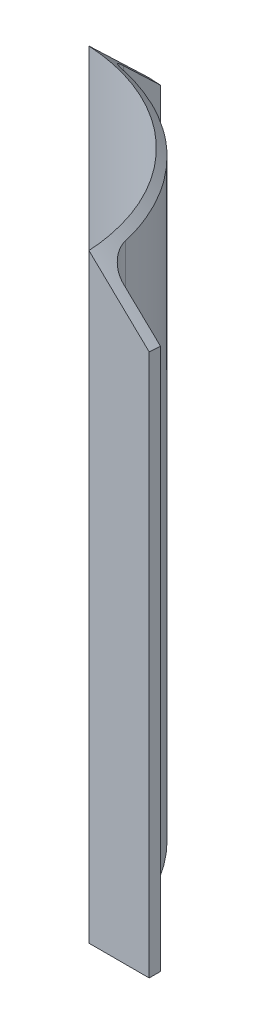
ISO-10303-21;
HEADER;
FILE_DESCRIPTION(('STEP AP214'),'2;1');
FILE_NAME('part.step','',(''),(''),'','','');
FILE_SCHEMA(('AUTOMOTIVE_DESIGN { 1 0 10303 214 1 1 1 1 }'));
ENDSEC;
DATA;
#1=APPLICATION_CONTEXT('core data for automotive mechanical design processes');
#2=APPLICATION_PROTOCOL_DEFINITION('international standard','automotive_design',2000,#1);
#3=PRODUCT_CONTEXT('',#1,'mechanical');
#4=PRODUCT('Part','Part','',(#3));
#5=PRODUCT_RELATED_PRODUCT_CATEGORY('part','',(#4));
#6=PRODUCT_DEFINITION_FORMATION('','',#4);
#7=PRODUCT_DEFINITION_CONTEXT('part definition',#1,'design');
#8=PRODUCT_DEFINITION('design','',#6,#7);
#9=PRODUCT_DEFINITION_SHAPE('','',#8);
#10=(LENGTH_UNIT() NAMED_UNIT(*) SI_UNIT(.MILLI.,.METRE.));
#11=(NAMED_UNIT(*) PLANE_ANGLE_UNIT() SI_UNIT($,.RADIAN.));
#12=(NAMED_UNIT(*) SI_UNIT($,.STERADIAN.) SOLID_ANGLE_UNIT());
#13=UNCERTAINTY_MEASURE_WITH_UNIT(LENGTH_MEASURE(1.E-05),#10,'distance_accuracy_value','');
#14=(GEOMETRIC_REPRESENTATION_CONTEXT(3) GLOBAL_UNCERTAINTY_ASSIGNED_CONTEXT((#13)) GLOBAL_UNIT_ASSIGNED_CONTEXT((#10,
#11,#12)) REPRESENTATION_CONTEXT('',''));
#15=CARTESIAN_POINT('',(0.,0.,0.));
#16=DIRECTION('',(0.,0.,1.));
#17=DIRECTION('',(1.,0.,0.));
#18=AXIS2_PLACEMENT_3D('',#15,#16,#17);
#19=CARTESIAN_POINT('',(0.,254.,0.));
#20=DIRECTION('',(0.,-1.,0.));
#21=DIRECTION('',(0.,0.,-1.));
#22=AXIS2_PLACEMENT_3D('',#19,#20,#21);
#23=CYLINDRICAL_SURFACE('',#22,82.55);
#24=CARTESIAN_POINT('',(80.3934085482758,249.863075794001,-18.7457291666667));
#25=CARTESIAN_POINT('',(80.3055245949603,249.86299530507,-19.1226304650302));
#26=CARTESIAN_POINT('',(80.214991316221,249.862903727339,-19.4989086364188));
#27=CARTESIAN_POINT('',(80.0286418855666,249.862746584679,-20.2501544756968));
#28=CARTESIAN_POINT('',(79.9328257345911,249.862681019746,-20.6251221438193));
#29=CARTESIAN_POINT('',(79.637481566626,249.862595631102,-21.7479443056426));
#30=CARTESIAN_POINT('',(79.4300533918061,249.862687104608,-22.4937370098891));
#31=CARTESIAN_POINT('',(78.994316159201,249.862938018383,-23.9791489815843));
#32=CARTESIAN_POINT('',(78.7660080560754,249.863097455547,-24.7187685295928));
#33=CARTESIAN_POINT('',(78.2886810993482,249.863352071069,-26.1912954488906));
#34=CARTESIAN_POINT('',(78.0396622484314,249.863447249437,-26.92420282105));
#35=CARTESIAN_POINT('',(77.521112248314,249.863547401683,-28.3827175233221));
#36=CARTESIAN_POINT('',(77.2515814249101,249.863552376993,-29.1083249691741));
#37=CARTESIAN_POINT('',(76.6922302653745,249.863533021055,-30.5516519187377));
#38=CARTESIAN_POINT('',(76.4024099283457,249.863508689806,-31.2693714221006));
#39=CARTESIAN_POINT('',(75.5034148686477,249.863413755424,-33.4084950572818));
#40=CARTESIAN_POINT('',(74.8641600647178,249.863321206738,-34.8173998291551));
#41=CARTESIAN_POINT('',(73.507561228147,249.863247879814,-37.5969794099592));
#42=CARTESIAN_POINT('',(72.7902181130919,249.863267100263,-38.9676546678725));
#43=CARTESIAN_POINT('',(71.2796830230458,249.86337279887,-41.6665414689077));
#44=CARTESIAN_POINT('',(70.4864916376567,249.863459276505,-42.994753342009));
#45=CARTESIAN_POINT('',(68.8263900470341,249.863568139322,-45.6050829830951));
#46=CARTESIAN_POINT('',(67.9594520944866,249.86359050027,-46.8871831409907));
#47=CARTESIAN_POINT('',(66.6061393361303,249.863219612162,-48.7721567820583));
#48=CARTESIAN_POINT('',(66.1461896433544,249.863028555391,-49.3941530233712));
#49=CARTESIAN_POINT('',(65.2089987282208,249.862670456499,-50.62496758798));
#50=CARTESIAN_POINT('',(64.731757506005,249.862503414378,-51.233785911384));
#51=CARTESIAN_POINT('',(63.2746135551357,249.862135205062,-53.0397794396304));
#52=CARTESIAN_POINT('',(62.2692090116158,249.862066900778,-54.2166067572427));
#53=CARTESIAN_POINT('',(60.7127733935497,249.86229477692,-55.9380077873409));
#54=CARTESIAN_POINT('',(60.1858149551967,249.862425840402,-56.5045921577349));
#55=CARTESIAN_POINT('',(59.1161567410984,249.862737922734,-57.6227470269512));
#56=CARTESIAN_POINT('',(58.573456964909,249.862918941585,-58.1743175253501));
#57=CARTESIAN_POINT('',(57.4727762095926,249.863258544191,-59.2619705887094));
#58=CARTESIAN_POINT('',(56.914795396594,249.86341712819,-59.7980533219154));
#59=CARTESIAN_POINT('',(55.783982790812,249.863558979771,-60.8543208572356));
#60=CARTESIAN_POINT('',(55.2111509984783,249.863542247358,-61.3745056598308));
#61=CARTESIAN_POINT('',(54.0511064931233,249.863353399875,-62.3985491131762));
#62=CARTESIAN_POINT('',(53.4638943101023,249.863181290523,-62.9024083640318));
#63=CARTESIAN_POINT('',(52.2755547362014,249.862825344858,-63.8934074793317));
#64=CARTESIAN_POINT('',(51.6744273447111,249.862641508545,-64.3805473430428));
#65=CARTESIAN_POINT('',(49.8501759336587,249.862193971594,-65.8168576006078));
#66=CARTESIAN_POINT('',(48.606740953747,249.862034519743,-66.7404258574518));
#67=CARTESIAN_POINT('',(46.0698416891314,249.862207495431,-68.5161994851546));
#68=CARTESIAN_POINT('',(44.7763753699932,249.862539942992,-69.3684019495829));
#69=CARTESIAN_POINT('',(42.8018261315508,249.863077775941,-70.5911177077228));
#70=CARTESIAN_POINT('',(42.1378393133121,249.863263604283,-70.9894678248497));
#71=CARTESIAN_POINT('',(40.7989030548139,249.863505883652,-71.7673420490157));
#72=CARTESIAN_POINT('',(40.1239536063261,249.863562334583,-72.1468661419235));
#73=CARTESIAN_POINT('',(38.7645334552431,249.863479544953,-72.8862907915338));
#74=CARTESIAN_POINT('',(38.0800762806611,249.863340558865,-73.2462162334988));
#75=CARTESIAN_POINT('',(36.7013225338603,249.863018972841,-73.9466925336815));
#76=CARTESIAN_POINT('',(36.0070259946014,249.862836373051,-74.287243456781));
#77=CARTESIAN_POINT('',(34.6092316329639,249.862513419291,-74.9486575814909));
#78=CARTESIAN_POINT('',(33.9057351605362,249.862373059195,-75.2695236330929));
#79=CARTESIAN_POINT('',(32.4900292176766,249.862170298839,-75.891359113194));
#80=CARTESIAN_POINT('',(31.7778196410206,249.862107899532,-76.1923282988378));
#81=CARTESIAN_POINT('',(29.6296589734328,249.862221769584,-77.0647336642277));
#82=CARTESIAN_POINT('',(28.1812872749114,249.862698645436,-77.6060881158168));
#83=CARTESIAN_POINT('',(26.0641581133361,249.86319902854,-78.3303368996885));
#84=CARTESIAN_POINT('',(25.4064311944375,249.863327484554,-78.546132892775));
#85=CARTESIAN_POINT('',(24.0858666064173,249.863491947967,-78.9610810958602));
#86=CARTESIAN_POINT('',(23.4230300137923,249.863527974332,-79.1602367123093));
#87=CARTESIAN_POINT('',(22.0936873677499,249.863552404625,-79.5414911928851));
#88=CARTESIAN_POINT('',(21.4271893940527,249.863540888813,-79.7236182730833));
#89=CARTESIAN_POINT('',(20.0896961360044,249.863473021325,-80.0711194873559));
#90=CARTESIAN_POINT('',(19.4186999677142,249.863416660564,-80.2364902192447));
#91=CARTESIAN_POINT('',(18.7457291666667,249.863339183168,-80.3934085482758));
#92=B_SPLINE_CURVE_WITH_KNOTS('',3,(#24,#25,#26,#27,#28,#29,#30,#31,#32,#33,#34,#35,#36,#37,#38,
#39,#40,#41,#42,#43,#44,#45,#46,#47,#48,#49,#50,#51,#52,#53,#54,#55,#56,#57,#58,#59,#60,#61,#62,
#63,#64,#65,#66,#67,#68,#69,#70,#71,#72,#73,#74,#75,#76,#77,#78,#79,#80,#81,#82,#83,#84,#85,#86,
#87,#88,#89,#90,#91),.UNSPECIFIED.,.F.,.F.,(4,2,2,2,2,2,2,2,2,2,2,2,2,2,2,2,2,2,2,2,2,2,2,2,2,2,
2,2,2,2,2,2,2,4),(0.,1.16101557393366,2.32203094135621,4.64400300459523,6.96586895705798,
9.28773460853185,11.6095633889233,13.9313922719684,18.5701678382414,23.2088889019222,
27.8475739097152,32.4880120190834,34.8084963534964,37.1289806688801,41.7695304906907,
44.0905784441235,46.4116264630263,48.7326492585908,51.0536719839024,53.3746092945134,
55.6955467069252,60.3396523238133,64.9839469838204,67.3066316233998,69.6293180064105,
71.9489828953981,74.2686400157781,76.5879604978694,78.9073092836852,83.5430614214433,
85.6195788327005,87.6956701134023,89.768257999085,91.841265860399),.UNSPECIFIED.);
#93=CARTESIAN_POINT('',(80.3934085482758,249.863075794001,-18.7457291666667));
#94=VERTEX_POINT('',#93);
#95=CARTESIAN_POINT('',(18.7457291666667,249.863339183168,-80.3934085482758));
#96=VERTEX_POINT('',#95);
#97=EDGE_CURVE('E363',#94,#96,#92,.T.);
#98=ORIENTED_EDGE('',*,*,#97,.F.);
#99=CARTESIAN_POINT('',(80.3934085482758,-12.6999999999999,-18.7457291666667));
#100=CARTESIAN_POINT('',(80.3934085482758,80.4333333333334,-18.7457291666667));
#101=CARTESIAN_POINT('',(80.3934085482758,173.566666666667,-18.7457291666667));
#102=CARTESIAN_POINT('',(80.3934085482758,266.7,-18.7457291666667));
#103=(BOUNDED_CURVE() B_SPLINE_CURVE(3,(#99,#100,#101,#102),.UNSPECIFIED.,.F.,
.F.) B_SPLINE_CURVE_WITH_KNOTS((4,4),(-0.0127,0.2667),
.UNSPECIFIED.) CURVE() GEOMETRIC_REPRESENTATION_ITEM() RATIONAL_B_SPLINE_CURVE((1.,1.,1.,1.)) REPRESENTATION_ITEM(''));
#104=CARTESIAN_POINT('',(80.3934085482758,0.,-18.7457291666667));
#105=VERTEX_POINT('',#104);
#106=EDGE_CURVE('E161',#94,#105,#103,.F.);
#107=ORIENTED_EDGE('',*,*,#106,.T.);
#108=CARTESIAN_POINT('',(0.,0.,0.));
#109=DIRECTION('',(0.,1.,0.));
#110=DIRECTION('',(0.,0.,1.));
#111=AXIS2_PLACEMENT_3D('',#108,#109,#110);
#112=CIRCLE('',#111,82.55);
#113=CARTESIAN_POINT('',(18.7457291666667,0.,-80.3934085482758));
#114=VERTEX_POINT('',#113);
#115=EDGE_CURVE('E185',#105,#114,#112,.T.);
#116=ORIENTED_EDGE('',*,*,#115,.T.);
#117=CARTESIAN_POINT('',(18.7457291666667,266.7,-80.3934085482758));
#118=CARTESIAN_POINT('',(18.7457291666667,173.566666666667,-80.3934085482758));
#119=CARTESIAN_POINT('',(18.7457291666667,80.4333333333334,-80.3934085482758));
#120=CARTESIAN_POINT('',(18.7457291666667,-12.6999999999999,-80.3934085482758));
#121=(BOUNDED_CURVE() B_SPLINE_CURVE(3,(#117,#118,#119,#120),.UNSPECIFIED.,.F.,
.F.) B_SPLINE_CURVE_WITH_KNOTS((4,4),(-0.0127,0.2667),
.UNSPECIFIED.) CURVE() GEOMETRIC_REPRESENTATION_ITEM() RATIONAL_B_SPLINE_CURVE((1.,1.,1.,1.)) REPRESENTATION_ITEM(''));
#122=EDGE_CURVE('E386',#114,#96,#121,.F.);
#123=ORIENTED_EDGE('',*,*,#122,.T.);
#124=EDGE_LOOP('',(#98,#107,#116,#123));
#125=FACE_BOUND('',#124,.T.);
#126=ADVANCED_FACE('F50',(#125),#23,.T.);
#127=CARTESIAN_POINT('',(0.,254.,0.));
#128=DIRECTION('',(0.,-1.,0.));
#129=DIRECTION('',(0.,0.,-1.));
#130=AXIS2_PLACEMENT_3D('',#127,#128,#129);
#131=CYLINDRICAL_SURFACE('',#130,79.375);
#132=CARTESIAN_POINT('',(3.57199999653287,252.9078,-79.2948402313923));
#133=CARTESIAN_POINT('',(3.90549281367887,252.9078,-79.2795649705891));
#134=CARTESIAN_POINT('',(4.24779404439881,252.9078,-79.2619222675122));
#135=CARTESIAN_POINT('',(5.27771800259052,252.9078,-79.2025001636546));
#136=CARTESIAN_POINT('',(5.97892391546024,252.9078,-79.1525855339356));
#137=CARTESIAN_POINT('',(7.39205282786649,252.9078,-79.0329024752258));
#138=CARTESIAN_POINT('',(8.10055468042552,252.90779999998,-78.9633313138953));
#139=CARTESIAN_POINT('',(10.2306940018551,252.90780000004,-78.7250170143436));
#140=CARTESIAN_POINT('',(11.6569652350676,252.90779999996,-78.5266730607213));
#141=CARTESIAN_POINT('',(15.9448865923597,252.90780000008,-77.8099425822413));
#142=CARTESIAN_POINT('',(18.8042149825534,252.907800000495,-77.1731014795492));
#143=CARTESIAN_POINT('',(24.5425969659521,252.907799999505,-75.5443382380577));
#144=CARTESIAN_POINT('',(27.3751677170329,252.9078,-74.5649446629202));
#145=CARTESIAN_POINT('',(32.9776852401022,252.9078,-72.2620660439728));
#146=CARTESIAN_POINT('',(35.7362026728139,252.9078,-70.9418250333983));
#147=CARTESIAN_POINT('',(43.7965907292001,252.9078,-66.4827919743856));
#148=CARTESIAN_POINT('',(48.8794150378731,252.9078,-62.8461687845427));
#149=CARTESIAN_POINT('',(58.0457333394796,252.9078,-54.4934031615025));
#150=CARTESIAN_POINT('',(62.126393996879,252.9078,-49.7801106609539));
#151=CARTESIAN_POINT('',(69.0152064792567,252.9078,-39.6818540198957));
#152=CARTESIAN_POINT('',(71.8150868601122,252.907799999183,-34.3207627298455));
#153=CARTESIAN_POINT('',(75.0332702923636,252.907800000409,-26.0601549211691));
#154=CARTESIAN_POINT('',(75.9310978906161,252.9078,-23.300955717258));
#155=CARTESIAN_POINT('',(77.4145679553548,252.9078,-17.76080557649));
#156=CARTESIAN_POINT('',(77.9933096889269,252.9078,-15.0090564604925));
#157=CARTESIAN_POINT('',(78.6410259423052,252.9078,-10.8599746315338));
#158=CARTESIAN_POINT('',(78.8159189303078,252.9078,-9.50174097017848));
#159=CARTESIAN_POINT('',(79.0261256566649,252.9078,-7.46259649540011));
#160=CARTESIAN_POINT('',(79.0871316696156,252.9078,-6.78497901199016));
#161=CARTESIAN_POINT('',(79.1914599093847,252.9078,-5.43463034347688));
#162=CARTESIAN_POINT('',(79.2347820342079,252.9078,-4.7618983190944));
#163=CARTESIAN_POINT('',(79.3041849104643,252.9078,-3.42201554037667));
#164=CARTESIAN_POINT('',(79.3306749729481,252.907799999963,-2.75823934906139));
#165=CARTESIAN_POINT('',(79.3715340968913,252.907800000037,-1.4394853358321));
#166=CARTESIAN_POINT('',(79.3859030554982,252.9078,-0.784506675463873));
#167=CARTESIAN_POINT('',(79.4068209061717,252.9078,0.520191015395428));
#168=CARTESIAN_POINT('',(79.4133697970696,252.9078,1.16991004497541));
#169=CARTESIAN_POINT('',(79.4229486501321,252.9078,2.4676255351467));
#170=CARTESIAN_POINT('',(79.4259787113971,252.9078,3.11562216923008));
#171=CARTESIAN_POINT('',(79.4328206420754,252.9078,4.41342923156643));
#172=CARTESIAN_POINT('',(79.4362430117968,252.9078,5.06256153883455));
#173=CARTESIAN_POINT('',(79.4430901403545,252.9078,6.36131692410462));
#174=CARTESIAN_POINT('',(79.4465149992489,252.9078,7.01094017636567));
#175=CARTESIAN_POINT('',(79.4567937306807,252.9078,8.96059800826002));
#176=CARTESIAN_POINT('',(79.4636517580429,252.9078,10.261420662976));
#177=CARTESIAN_POINT('',(79.4842446269416,252.9078,14.167452097157));
#178=CARTESIAN_POINT('',(79.497998255515,252.9078,16.7762243465932));
#179=CARTESIAN_POINT('',(79.5117827135053,252.9078,19.3908443416948));
#180=B_SPLINE_CURVE_WITH_KNOTS('',3,(#132,#133,#134,#135,#136,#137,#138,#139,#140,#141,#142,
#143,#144,#145,#146,#147,#148,#149,#150,#151,#152,#153,#154,#155,#156,#157,#158,#159,#160,#161,
#162,#163,#164,#165,#166,#167,#168,#169,#170,#171,#172,#173,#174,#175,#176,#177,#178,#179),
.UNSPECIFIED.,.F.,.F.,(4,2,2,2,2,2,2,2,2,2,2,2,2,2,2,2,2,2,2,2,2,2,2,4),(0.,0.00712694721209857,
0.0226405886619095,0.0381542301117205,0.0691815130113424,0.131236078810586,0.19329064460983,
0.255345210409074,0.379454342007562,0.503563473606049,0.627672605204537,0.689727171003781,
0.751781736803025,0.782809019702646,0.798322661152457,0.813836302602268,0.82934994405208,
0.84486358550189,0.860377226951701,0.875890868401512,0.891404509851323,0.906918151301134,
0.937945434200756,1.),.UNSPECIFIED.);
#181=CARTESIAN_POINT('',(4.572,252.9078,-79.2432170030975));
#182=VERTEX_POINT('',#181);
#183=CARTESIAN_POINT('',(79.2432170030975,252.907776200921,-4.57199999999972));
#184=VERTEX_POINT('',#183);
#185=EDGE_CURVE('E129',#182,#184,#180,.T.);
#186=ORIENTED_EDGE('',*,*,#185,.F.);
#187=DIRECTION('',(0.,-1.,0.));
#188=VECTOR('',#187,1.);
#189=CARTESIAN_POINT('',(4.572,254.,-79.2432170030975));
#190=LINE('',#189,#188);
#191=CARTESIAN_POINT('',(4.572,0.,-79.2432170030975));
#192=VERTEX_POINT('',#191);
#193=EDGE_CURVE('E145',#182,#192,#190,.T.);
#194=ORIENTED_EDGE('',*,*,#193,.T.);
#195=CARTESIAN_POINT('',(0.,0.,0.));
#196=DIRECTION('',(0.,-1.,0.));
#197=DIRECTION('',(0.,0.,1.));
#198=AXIS2_PLACEMENT_3D('',#195,#196,#197);
#199=CIRCLE('',#198,79.375);
#200=CARTESIAN_POINT('',(79.2432170030975,0.,-4.57199999999972));
#201=VERTEX_POINT('',#200);
#202=EDGE_CURVE('E409',#192,#201,#199,.T.);
#203=ORIENTED_EDGE('',*,*,#202,.T.);
#204=DIRECTION('',(0.,1.,0.));
#205=VECTOR('',#204,1.);
#206=CARTESIAN_POINT('',(79.2432170030975,254.,-4.57199999999972));
#207=LINE('',#206,#205);
#208=EDGE_CURVE('E148',#184,#201,#207,.F.);
#209=ORIENTED_EDGE('',*,*,#208,.F.);
#210=EDGE_LOOP('',(#186,#194,#203,#209));
#211=FACE_BOUND('',#210,.T.);
#212=ADVANCED_FACE('F143',(#211),#131,.F.);
#213=CARTESIAN_POINT('',(9.33450000000005,0.,0.));
#214=DIRECTION('',(-1.,0.,0.));
#215=DIRECTION('',(0.,0.,1.));
#216=AXIS2_PLACEMENT_3D('',#213,#214,#215);
#217=PLANE('',#216);
#218=CARTESIAN_POINT('',(9.3345,243.163015443738,-89.0511602380901));
#219=CARTESIAN_POINT('',(9.3345,241.923986864279,-90.3508813240916));
#220=CARTESIAN_POINT('',(9.3345,240.684841707845,-91.6504912684778));
#221=CARTESIAN_POINT('',(9.33449999999999,238.206343197414,-94.249512565232));
#222=CARTESIAN_POINT('',(9.33449999999999,236.966989843421,-95.5489239176039));
#223=CARTESIAN_POINT('',(9.33449999999999,234.488099845498,-98.1475717726849));
#224=CARTESIAN_POINT('',(9.33449999999999,233.248563201568,-99.4468082753942));
#225=CARTESIAN_POINT('',(9.33449999999999,230.769326188929,-102.045125110612));
#226=CARTESIAN_POINT('',(9.33449999999999,229.529625820215,-103.344205443117));
#227=CARTESIAN_POINT('',(9.33449999999999,228.289853397595,-104.643217003097));
#228=B_SPLINE_CURVE_WITH_KNOTS('',3,(#218,#219,#220,#221,#222,#223,#224,#225,#226,#227),
.UNSPECIFIED.,.F.,.F.,(4,2,2,2,4),(0.,5.38704003392801,10.774079958566,16.161119876607,
21.5481599039379),.UNSPECIFIED.);
#229=CARTESIAN_POINT('',(9.3345,243.163015443738,-89.0511602380901));
#230=VERTEX_POINT('',#229);
#231=CARTESIAN_POINT('',(9.33449999999999,228.289853397595,-104.643217003098));
#232=VERTEX_POINT('',#231);
#233=EDGE_CURVE('E282',#230,#232,#228,.T.);
#234=ORIENTED_EDGE('',*,*,#233,.F.);
#235=CARTESIAN_POINT('',(9.3345,-12.6999999999999,-89.0511602380901));
#236=CARTESIAN_POINT('',(9.3345,80.4333333333334,-89.0511602380901));
#237=CARTESIAN_POINT('',(9.3345,173.566666666667,-89.0511602380901));
#238=CARTESIAN_POINT('',(9.3345,266.7,-89.0511602380901));
#239=(BOUNDED_CURVE() B_SPLINE_CURVE(3,(#235,#236,#237,#238),.UNSPECIFIED.,.F.,
.F.) B_SPLINE_CURVE_WITH_KNOTS((4,4),(-0.0127,0.2667),
.UNSPECIFIED.) CURVE() GEOMETRIC_REPRESENTATION_ITEM() RATIONAL_B_SPLINE_CURVE((1.,1.,1.,1.)) REPRESENTATION_ITEM(''));
#240=CARTESIAN_POINT('',(9.3345,0.,-89.0511602380901));
#241=VERTEX_POINT('',#240);
#242=EDGE_CURVE('E158',#230,#241,#239,.F.);
#243=ORIENTED_EDGE('',*,*,#242,.T.);
#244=DIRECTION('',(0.,0.,-1.));
#245=VECTOR('',#244,1.);
#246=CARTESIAN_POINT('',(9.3345,0.,-79.2432170030975));
#247=LINE('',#246,#245);
#248=CARTESIAN_POINT('',(9.33449999999999,0.,-104.643217003097));
#249=VERTEX_POINT('',#248);
#250=EDGE_CURVE('E247',#241,#249,#247,.T.);
#251=ORIENTED_EDGE('',*,*,#250,.T.);
#252=DIRECTION('',(0.,-1.,0.));
#253=VECTOR('',#252,1.);
#254=CARTESIAN_POINT('',(9.33449999999999,254.,-104.643217003098));
#255=LINE('',#254,#253);
#256=EDGE_CURVE('E244',#232,#249,#255,.T.);
#257=ORIENTED_EDGE('',*,*,#256,.F.);
#258=EDGE_LOOP('',(#234,#243,#251,#257));
#259=FACE_BOUND('',#258,.T.);
#260=ADVANCED_FACE('F259',(#259),#217,.F.);
#261=CARTESIAN_POINT('',(9.33449999999999,254.,-104.643217003098));
#262=DIRECTION('',(0.,0.,-1.));
#263=DIRECTION('',(-1.,0.,0.));
#264=AXIS2_PLACEMENT_3D('',#261,#262,#263);
#265=PLANE('',#264);
#266=DIRECTION('',(0.,-1.,0.));
#267=VECTOR('',#266,1.);
#268=CARTESIAN_POINT('',(4.57199999999999,254.,-104.643217003098));
#269=LINE('',#268,#267);
#270=CARTESIAN_POINT('',(4.57199999999999,228.592589746728,-104.643217003097));
#271=VERTEX_POINT('',#270);
#272=CARTESIAN_POINT('',(4.57199999999999,0.,-104.643217003097));
#273=VERTEX_POINT('',#272);
#274=EDGE_CURVE('E243',#271,#273,#269,.T.);
#275=ORIENTED_EDGE('',*,*,#274,.F.);
#276=CARTESIAN_POINT('',(4.57199999999999,228.592589746728,-104.643217003098));
#277=CARTESIAN_POINT('',(4.83693443903542,228.581611468444,-104.643217003098));
#278=CARTESIAN_POINT('',(5.10182735115611,228.56963280302,-104.643217003098));
#279=CARTESIAN_POINT('',(5.63148794281116,228.543693914518,-104.643217003098));
#280=CARTESIAN_POINT('',(5.89625563266225,228.529733902151,-104.643217003098));
#281=CARTESIAN_POINT('',(6.42566638973623,228.499849958974,-104.643217003098));
#282=CARTESIAN_POINT('',(6.69030946263522,228.483926128543,-104.643217003098));
#283=CARTESIAN_POINT('',(7.21947621249579,228.450213141003,-104.643217003098));
#284=CARTESIAN_POINT('',(7.48399988967059,228.432423987238,-104.643217003098));
#285=CARTESIAN_POINT('',(8.01292655729358,228.394943176434,-104.643217003098));
#286=CARTESIAN_POINT('',(8.27732954061907,228.375251418825,-104.643217003098));
#287=CARTESIAN_POINT('',(8.80601520091454,228.333972051785,-104.643217003098));
#288=CARTESIAN_POINT('',(9.07029786247727,228.312384245014,-104.643217003098));
#289=CARTESIAN_POINT('',(9.33449999999999,228.289853397595,-104.643217003098));
#290=B_SPLINE_CURVE_WITH_KNOTS('',3,(#276,#277,#278,#279,#280,#281,#282,#283,#284,#285,#286,
#287,#288,#289),.UNSPECIFIED.,.F.,.F.,(4,2,2,2,2,2,4),(0.,0.795483435392604,1.59088233718429,
2.38624060007188,3.18159743692581,3.97699633810906,4.77247812231801),.UNSPECIFIED.);
#291=EDGE_CURVE('E133',#271,#232,#290,.T.);
#292=ORIENTED_EDGE('',*,*,#291,.T.);
#293=ORIENTED_EDGE('',*,*,#256,.T.);
#294=DIRECTION('',(-1.,0.,0.));
#295=VECTOR('',#294,1.);
#296=CARTESIAN_POINT('',(9.33449999999999,0.,-104.643217003097));
#297=LINE('',#296,#295);
#298=EDGE_CURVE('E255',#249,#273,#297,.T.);
#299=ORIENTED_EDGE('',*,*,#298,.T.);
#300=EDGE_LOOP('',(#275,#292,#293,#299));
#301=FACE_BOUND('',#300,.T.);
#302=ADVANCED_FACE('F268',(#301),#265,.T.);
#303=CARTESIAN_POINT('',(0.,0.,-9.3345));
#304=DIRECTION('',(0.,0.,1.));
#305=DIRECTION('',(1.,0.,0.));
#306=AXIS2_PLACEMENT_3D('',#303,#304,#305);
#307=PLANE('',#306);
#308=CARTESIAN_POINT('',(104.643217003098,228.289850813903,-9.3345));
#309=CARTESIAN_POINT('',(103.344202298068,229.529642833696,-9.3345));
#310=CARTESIAN_POINT('',(102.045119929263,230.769363962389,-9.3345));
#311=CARTESIAN_POINT('',(99.446800659232,233.248644214879,-9.3345));
#312=CARTESIAN_POINT('',(98.1475637580095,234.48820333868,-9.3345));
#313=CARTESIAN_POINT('',(95.5489161647589,236.967139409769,-9.3345));
#314=CARTESIAN_POINT('',(94.2495054727304,238.206516357056,-9.3345));
#315=CARTESIAN_POINT('',(91.6504867419004,240.685063363352,-9.3345));
#316=CARTESIAN_POINT('',(90.3508787030948,241.924233422357,-9.3345));
#317=CARTESIAN_POINT('',(89.0511602380901,243.163287657327,-9.3345));
#318=B_SPLINE_CURVE_WITH_KNOTS('',3,(#308,#309,#310,#311,#312,#313,#314,#315,#316,#317),
.UNSPECIFIED.,.F.,.F.,(4,2,2,2,4),(0.,5.38708744396772,10.7741747802693,16.1612621231748,
21.5483495737463),.UNSPECIFIED.);
#319=CARTESIAN_POINT('',(104.643217003098,228.289850813903,-9.3345));
#320=VERTEX_POINT('',#319);
#321=CARTESIAN_POINT('',(89.0511602380901,243.163287657327,-9.33450000000001));
#322=VERTEX_POINT('',#321);
#323=EDGE_CURVE('E72',#320,#322,#318,.T.);
#324=ORIENTED_EDGE('',*,*,#323,.F.);
#325=DIRECTION('',(0.,1.,0.));
#326=VECTOR('',#325,1.);
#327=CARTESIAN_POINT('',(104.643217003098,254.,-9.3345));
#328=LINE('',#327,#326);
#329=CARTESIAN_POINT('',(104.643217003098,0.,-9.3345));
#330=VERTEX_POINT('',#329);
#331=EDGE_CURVE('E219',#330,#320,#328,.T.);
#332=ORIENTED_EDGE('',*,*,#331,.F.);
#333=DIRECTION('',(1.,0.,0.));
#334=VECTOR('',#333,1.);
#335=CARTESIAN_POINT('',(79.2432170030975,0.,-9.3345));
#336=LINE('',#335,#334);
#337=CARTESIAN_POINT('',(89.0511602380901,0.,-9.3345));
#338=VERTEX_POINT('',#337);
#339=EDGE_CURVE('E210',#338,#330,#336,.T.);
#340=ORIENTED_EDGE('',*,*,#339,.F.);
#341=CARTESIAN_POINT('',(89.0511602380901,266.7,-9.33450000000001));
#342=CARTESIAN_POINT('',(89.0511602380901,173.566666666667,-9.33450000000001));
#343=CARTESIAN_POINT('',(89.0511602380901,80.4333333333334,-9.33450000000001));
#344=CARTESIAN_POINT('',(89.0511602380901,-12.6999999999999,-9.33450000000001));
#345=(BOUNDED_CURVE() B_SPLINE_CURVE(3,(#341,#342,#343,#344),.UNSPECIFIED.,.F.,
.F.) B_SPLINE_CURVE_WITH_KNOTS((4,4),(-0.0127,0.2667),
.UNSPECIFIED.) CURVE() GEOMETRIC_REPRESENTATION_ITEM() RATIONAL_B_SPLINE_CURVE((1.,1.,1.,1.)) REPRESENTATION_ITEM(''));
#346=EDGE_CURVE('E375',#338,#322,#345,.F.);
#347=ORIENTED_EDGE('',*,*,#346,.T.);
#348=EDGE_LOOP('',(#324,#332,#340,#347));
#349=FACE_BOUND('',#348,.T.);
#350=ADVANCED_FACE('F292',(#349),#307,.F.);
#351=CARTESIAN_POINT('',(104.643217003098,254.,-9.3345));
#352=DIRECTION('',(1.,0.,0.));
#353=DIRECTION('',(0.,1.,0.));
#354=AXIS2_PLACEMENT_3D('',#351,#352,#353);
#355=PLANE('',#354);
#356=ORIENTED_EDGE('',*,*,#331,.T.);
#357=CARTESIAN_POINT('',(104.643217003098,228.289850813903,-9.3345));
#358=CARTESIAN_POINT('',(104.643217003098,228.306724543109,-9.13634558481854));
#359=CARTESIAN_POINT('',(104.643217003098,228.323080945564,-8.93814702143523));
#360=CARTESIAN_POINT('',(104.643217003098,228.354740692036,-8.54168373564605));
#361=CARTESIAN_POINT('',(104.643217003098,228.370044130502,-8.34341902078116));
#362=CARTESIAN_POINT('',(104.643217003098,228.399581673779,-7.946822156931));
#363=CARTESIAN_POINT('',(104.643217003098,228.413815844232,-7.74849001283732));
#364=CARTESIAN_POINT('',(104.643217003098,228.441186096512,-7.35175608248459));
#365=CARTESIAN_POINT('',(104.643217003098,228.454322212475,-7.15335429858336));
#366=CARTESIAN_POINT('',(104.643217003098,228.479451779381,-6.75647828987829));
#367=CARTESIAN_POINT('',(104.643217003098,228.491445229964,-6.55800406505172));
#368=CARTESIAN_POINT('',(104.643217003098,228.514310354513,-6.16098496252986));
#369=CARTESIAN_POINT('',(104.643217003098,228.525181994083,-5.96244008285533));
#370=CARTESIAN_POINT('',(104.643217003098,228.545843744306,-5.56528189216292));
#371=CARTESIAN_POINT('',(104.643217003098,228.555633788067,-5.36666857767373));
#372=CARTESIAN_POINT('',(104.643217003098,228.574196791035,-4.96937669063218));
#373=CARTESIAN_POINT('',(104.643217003098,228.582969659832,-4.77069811385058));
#374=CARTESIAN_POINT('',(104.643217003097,228.591265688568,-4.572));
#375=B_SPLINE_CURVE_WITH_KNOTS('',3,(#357,#358,#359,#360,#361,#362,#363,#364,#365,#366,#367,
#368,#369,#370,#371,#372,#373,#374),.UNSPECIFIED.,.F.,.F.,(4,2,2,2,2,2,2,2,4),(0.,
0.596614123736033,1.19317466214033,1.78969854782272,2.38620388068587,2.98270940089969,
3.57923320584795,4.17579388326858,4.77240754454153),.UNSPECIFIED.);
#376=CARTESIAN_POINT('',(104.643217003077,228.591265688588,-4.57199999999964));
#377=VERTEX_POINT('',#376);
#378=EDGE_CURVE('E351',#320,#377,#375,.T.);
#379=ORIENTED_EDGE('',*,*,#378,.T.);
#380=DIRECTION('',(0.,1.,0.));
#381=VECTOR('',#380,1.);
#382=CARTESIAN_POINT('',(104.643217003098,254.,-4.572));
#383=LINE('',#382,#381);
#384=CARTESIAN_POINT('',(104.643217003098,0.,-4.572));
#385=VERTEX_POINT('',#384);
#386=EDGE_CURVE('E220',#385,#377,#383,.T.);
#387=ORIENTED_EDGE('',*,*,#386,.F.);
#388=DIRECTION('',(0.,0.,1.));
#389=VECTOR('',#388,1.);
#390=CARTESIAN_POINT('',(104.643217003098,0.,-9.3345));
#391=LINE('',#390,#389);
#392=EDGE_CURVE('E236',#330,#385,#391,.T.);
#393=ORIENTED_EDGE('',*,*,#392,.F.);
#394=EDGE_LOOP('',(#356,#379,#387,#393));
#395=FACE_BOUND('',#394,.T.);
#396=ADVANCED_FACE('F270',(#395),#355,.T.);
#397=CARTESIAN_POINT('',(9.3345,266.7,-89.0511602380901));
#398=CARTESIAN_POINT('',(9.3345,173.566666666667,-89.0511602380901));
#399=CARTESIAN_POINT('',(9.3345,80.4333333333334,-89.0511602380901));
#400=CARTESIAN_POINT('',(9.3345,-12.6999999999999,-89.0511602380901));
#401=CARTESIAN_POINT('',(9.33449999999999,266.7,-82.5878714559883));
#402=CARTESIAN_POINT('',(9.33449999999999,173.566666666667,-82.5878714559883));
#403=CARTESIAN_POINT('',(9.33449999999999,80.4333333333334,-82.5878714559883));
#404=CARTESIAN_POINT('',(9.33449999999999,-12.6999999999999,-82.5878714559883));
#405=CARTESIAN_POINT('',(18.7457291666667,266.7,-80.3934085482758));
#406=CARTESIAN_POINT('',(18.7457291666667,173.566666666667,-80.3934085482758));
#407=CARTESIAN_POINT('',(18.7457291666667,80.4333333333334,-80.3934085482758));
#408=CARTESIAN_POINT('',(18.7457291666667,-12.6999999999999,-80.3934085482758));
#409=(BOUNDED_SURFACE() B_SPLINE_SURFACE(2,3,((#397,#398,#399,#400),(#401,#402,#403,#404),(#405,
#406,#407,#408)),.UNSPECIFIED.,.F.,.F.,.F.) B_SPLINE_SURFACE_WITH_KNOTS((3,3),(4,4),(0.,1.),
(-0.0127,0.2667),.UNSPECIFIED.) GEOMETRIC_REPRESENTATION_ITEM() RATIONAL_B_SPLINE_SURFACE(((1.,
1.,1.,1.),(0.78328900583799,0.78328900583799,0.78328900583799,0.78328900583799),(1.,1.,1.,1.))) REPRESENTATION_ITEM('') SURFACE());
#410=CARTESIAN_POINT('',(18.7457291666667,249.863339183168,-80.3934085482758));
#411=CARTESIAN_POINT('',(18.5868309855453,249.863319100062,-80.4304596511373));
#412=CARTESIAN_POINT('',(18.4284487023067,249.860728423183,-80.4696430548281));
#413=CARTESIAN_POINT('',(18.1129638953334,249.850381118908,-80.5522521436858));
#414=CARTESIAN_POINT('',(17.9558613782601,249.84262446464,-80.5956778509193));
#415=CARTESIAN_POINT('',(17.4868802254988,249.811570571639,-80.7322749202319));
#416=CARTESIAN_POINT('',(17.1772950296904,249.780489408682,-80.8317739004661));
#417=CARTESIAN_POINT('',(16.5668155204279,249.697660254297,-81.047150114985));
#418=CARTESIAN_POINT('',(16.2659194295685,249.64591652209,-81.1630239707031));
#419=CARTESIAN_POINT('',(15.6750199614711,249.522112187088,-81.4105925596353));
#420=CARTESIAN_POINT('',(15.3850158156679,249.45005302087,-81.5422861738008));
#421=CARTESIAN_POINT('',(14.8192563661105,249.286540078477,-81.8202255868636));
#422=CARTESIAN_POINT('',(14.5434490038264,249.195164537181,-81.9664114578568));
#423=CARTESIAN_POINT('',(14.0069640444189,248.993667277914,-82.2729417141023));
#424=CARTESIAN_POINT('',(13.7462863387542,248.88354569445,-82.4332859977603));
#425=CARTESIAN_POINT('',(13.2421699035511,248.645590859548,-82.7671332149614));
#426=CARTESIAN_POINT('',(12.9987244108588,248.51776461558,-82.9406309301641));
#427=CARTESIAN_POINT('',(12.5308534362213,248.245513907776,-83.2998152940644));
#428=CARTESIAN_POINT('',(12.3064275711833,248.101089778391,-83.485501697124));
#429=CARTESIAN_POINT('',(11.8825375330402,247.799894585931,-83.8642359809575));
#430=CARTESIAN_POINT('',(11.6826721956261,247.643418927295,-84.0570699314751));
#431=CARTESIAN_POINT('',(11.304498923142,247.3170572635,-84.4522890595301));
#432=CARTESIAN_POINT('',(11.1261905323389,247.147171541968,-84.6546740350245));
#433=CARTESIAN_POINT('',(10.7926011965694,246.795377727421,-85.0678187072662));
#434=CARTESIAN_POINT('',(10.6373206136729,246.613469445438,-85.2785785356266));
#435=CARTESIAN_POINT('',(10.3511776766798,246.239112237782,-85.7071917746782));
#436=CARTESIAN_POINT('',(10.220315149533,246.046663386822,-85.925045135085));
#437=CARTESIAN_POINT('',(9.97726178949469,245.641034491574,-86.3796316855766));
#438=CARTESIAN_POINT('',(9.86664525370858,245.427302261195,-86.6167169608619));
#439=CARTESIAN_POINT('',(9.6756502237307,244.99169943963,-87.0955244991688));
#440=CARTESIAN_POINT('',(9.59527111045065,244.769829015169,-87.3372466671471));
#441=CARTESIAN_POINT('',(9.46574010151485,244.319303429659,-87.8241393255042));
#442=CARTESIAN_POINT('',(9.4166763778371,244.090630992338,-88.0693175830638));
#443=CARTESIAN_POINT('',(9.36745870257052,243.744672177438,-88.4375073445848));
#444=CARTESIAN_POINT('',(9.35511575155714,243.628823314546,-88.5603470588363));
#445=CARTESIAN_POINT('',(9.33863577820224,243.396400500921,-88.8059065514043));
#446=CARTESIAN_POINT('',(9.33449932542125,243.279826500424,-88.9286263208056));
#447=CARTESIAN_POINT('',(9.3345,243.163015443738,-89.0511602380901));
#448=B_SPLINE_CURVE_WITH_KNOTS('',3,(#410,#411,#412,#413,#414,#415,#416,#417,#418,#419,#420,
#421,#422,#423,#424,#425,#426,#427,#428,#429,#430,#431,#432,#433,#434,#435,#436,#437,#438,#439,
#440,#441,#442,#443,#444,#445,#446,#447),.UNSPECIFIED.,.F.,.F.,(4,2,2,2,2,2,2,2,2,2,2,2,2,2,2,2,
2,2,4),(0.,0.489410191263985,0.97882292835434,1.95754720611456,2.93606984140393,
3.91452329926338,4.88908727113276,5.86364425054972,6.83781659861844,7.81196932027118,
8.7671411304034,9.72229274382022,10.6774593736514,11.6326192339802,12.6446123677236,
13.6565847805471,14.6713940895076,15.1791239728488,15.6868890932398),.UNSPECIFIED.);
#449=EDGE_CURVE('E358',#96,#230,#448,.T.);
#450=CARTESIAN_POINT('',(18.7457291666667,0.,-80.3934085482758));
#451=CARTESIAN_POINT('',(9.33449999999999,0.,-82.5878714559883));
#452=CARTESIAN_POINT('',(9.3345,0.,-89.0511602380901));
#453=(BOUNDED_CURVE() B_SPLINE_CURVE(2,(#450,#451,#452),.UNSPECIFIED.,.F.,
.F.) B_SPLINE_CURVE_WITH_KNOTS((3,3),(0.,1.),
.UNSPECIFIED.) CURVE() GEOMETRIC_REPRESENTATION_ITEM() RATIONAL_B_SPLINE_CURVE((1.,
0.78328900583799,1.)) REPRESENTATION_ITEM(''));
#454=EDGE_CURVE('E385',#241,#114,#453,.F.);
#455=ORIENTED_EDGE('',*,*,#449,.F.);
#456=ORIENTED_EDGE('',*,*,#122,.F.);
#457=ORIENTED_EDGE('',*,*,#454,.F.);
#458=ORIENTED_EDGE('',*,*,#242,.F.);
#459=EDGE_LOOP('',(#455,#456,#457,#458));
#460=FACE_BOUND('',#459,.T.);
#461=ADVANCED_FACE('F200',(#460),#409,.T.);
#462=CARTESIAN_POINT('',(80.3934085482758,266.7,-18.7457291666667));
#463=CARTESIAN_POINT('',(80.3934085482758,173.566666666667,-18.7457291666667));
#464=CARTESIAN_POINT('',(80.3934085482758,80.4333333333334,-18.7457291666667));
#465=CARTESIAN_POINT('',(80.3934085482758,-12.6999999999999,-18.7457291666667));
#466=CARTESIAN_POINT('',(82.5878714559883,266.7,-9.3345));
#467=CARTESIAN_POINT('',(82.5878714559883,173.566666666667,-9.3345));
#468=CARTESIAN_POINT('',(82.5878714559883,80.4333333333334,-9.3345));
#469=CARTESIAN_POINT('',(82.5878714559883,-12.6999999999999,-9.3345));
#470=CARTESIAN_POINT('',(89.0511602380901,266.7,-9.33450000000001));
#471=CARTESIAN_POINT('',(89.0511602380901,173.566666666667,-9.33450000000001));
#472=CARTESIAN_POINT('',(89.0511602380901,80.4333333333334,-9.33450000000001));
#473=CARTESIAN_POINT('',(89.0511602380901,-12.6999999999999,-9.33450000000001));
#474=(BOUNDED_SURFACE() B_SPLINE_SURFACE(2,3,((#462,#463,#464,#465),(#466,#467,#468,#469),(#470,
#471,#472,#473)),.UNSPECIFIED.,.F.,.F.,.F.) B_SPLINE_SURFACE_WITH_KNOTS((3,3),(4,4),(0.,1.),
(-0.0127,0.2667),.UNSPECIFIED.) GEOMETRIC_REPRESENTATION_ITEM() RATIONAL_B_SPLINE_SURFACE(((1.,
1.,1.,1.),(0.78328900583799,0.78328900583799,0.78328900583799,0.78328900583799),(1.,1.,1.,1.))) REPRESENTATION_ITEM('') SURFACE());
#475=CARTESIAN_POINT('',(89.0511602380901,243.163287657327,-9.3345));
#476=CARTESIAN_POINT('',(88.836153362373,243.36825208237,-9.33446140025383));
#477=CARTESIAN_POINT('',(88.6205384446103,243.572531834549,-9.34722909303749));
#478=CARTESIAN_POINT('',(88.1896270376348,243.978180557363,-9.39783083760947));
#479=CARTESIAN_POINT('',(87.9743304727508,244.179550376202,-9.43565742810408));
#480=CARTESIAN_POINT('',(87.5459177179545,244.577536865759,-9.53572457990829));
#481=CARTESIAN_POINT('',(87.3327978581697,244.774162754655,-9.59791292010697));
#482=CARTESIAN_POINT('',(86.9096023581733,245.161716931459,-9.74594830688385));
#483=CARTESIAN_POINT('',(86.6995269055451,245.352644869046,-9.83179680483069));
#484=CARTESIAN_POINT('',(86.2827232147005,245.728307903648,-10.0267208363684));
#485=CARTESIAN_POINT('',(86.0760148238985,245.913010465985,-10.1359014191496));
#486=CARTESIAN_POINT('',(85.6680224883766,246.274069971873,-10.3763064871302));
#487=CARTESIAN_POINT('',(85.4667409491642,246.45042323987,-10.5075405672371));
#488=CARTESIAN_POINT('',(85.0707062107271,246.7935166382,-10.7909929353509));
#489=CARTESIAN_POINT('',(84.875955500651,246.960253120253,-10.9432191137403));
#490=CARTESIAN_POINT('',(84.4941541413503,247.282784539677,-11.2673963773625));
#491=CARTESIAN_POINT('',(84.3071004769502,247.438583778726,-11.4393396368883));
#492=CARTESIAN_POINT('',(83.9333132666537,247.744946515354,-11.8099568049116));
#493=CARTESIAN_POINT('',(83.7469743550041,247.8949572891,-12.0094863536823));
#494=CARTESIAN_POINT('',(83.3846725288634,248.180673117395,-12.4273318864144));
#495=CARTESIAN_POINT('',(83.2087099830739,248.316377663738,-12.6456485372574));
#496=CARTESIAN_POINT('',(82.8680693175446,248.572424453514,-13.0995583776507));
#497=CARTESIAN_POINT('',(82.7033949777807,248.692761562525,-13.3351573002112));
#498=CARTESIAN_POINT('',(82.3862890581731,248.917011961337,-13.8218839527942));
#499=CARTESIAN_POINT('',(82.2338571373144,249.020925708692,-14.0730112499257));
#500=CARTESIAN_POINT('',(81.9390694996018,249.213399385972,-14.5942877513023));
#501=CARTESIAN_POINT('',(81.796982124864,249.301603633171,-14.8647201435306));
#502=CARTESIAN_POINT('',(81.5271638343226,249.459253831817,-15.4179341618366));
#503=CARTESIAN_POINT('',(81.3994330648565,249.528699592067,-15.7007159137509));
#504=CARTESIAN_POINT('',(81.15913864916,249.648216019362,-16.2761928334436));
#505=CARTESIAN_POINT('',(81.0465566618123,249.698310256006,-16.5688754664455));
#506=CARTESIAN_POINT('',(80.8369475047776,249.778915688508,-17.1622610775664));
#507=CARTESIAN_POINT('',(80.7399127928755,249.809436401483,-17.4629600837392));
#508=CARTESIAN_POINT('',(80.6033610494999,249.841191916356,-17.9284356457975));
#509=CARTESIAN_POINT('',(80.5581441658297,249.849446976329,-18.0911145249422));
#510=CARTESIAN_POINT('',(80.4723318841645,249.860403715299,-18.4175905505286));
#511=CARTESIAN_POINT('',(80.4317291179837,249.863114369166,-18.5813854584259));
#512=CARTESIAN_POINT('',(80.3934085482758,249.863075794001,-18.7457291666667));
#513=B_SPLINE_CURVE_WITH_KNOTS('',3,(#475,#476,#477,#478,#479,#480,#481,#482,#483,#484,#485,
#486,#487,#488,#489,#490,#491,#492,#493,#494,#495,#496,#497,#498,#499,#500,#501,#502,#503,#504,
#505,#506,#507,#508,#509,#510,#511,#512),.UNSPECIFIED.,.F.,.F.,(4,2,2,2,2,2,2,2,2,2,2,2,2,2,2,2,
2,2,4),(0.,0.890824888365313,1.78138465251853,2.67004579445007,3.55876146104328,
4.45156606656842,5.34476011879335,6.2382908191324,7.13146809678044,8.06491352995509,
8.99839211111886,9.93218176578689,10.8659454005362,11.8187206383197,12.7715055868921,
13.7231263841986,14.6742841291175,15.1812885169719,15.6874715524706),.UNSPECIFIED.);
#514=EDGE_CURVE('E12',#322,#94,#513,.T.);
#515=CARTESIAN_POINT('',(89.0511602380901,0.,-9.33450000000001));
#516=CARTESIAN_POINT('',(82.5878714559883,0.,-9.3345));
#517=CARTESIAN_POINT('',(80.3934085482758,0.,-18.7457291666667));
#518=(BOUNDED_CURVE() B_SPLINE_CURVE(2,(#515,#516,#517),.UNSPECIFIED.,.F.,
.F.) B_SPLINE_CURVE_WITH_KNOTS((3,3),(0.,1.),
.UNSPECIFIED.) CURVE() GEOMETRIC_REPRESENTATION_ITEM() RATIONAL_B_SPLINE_CURVE((1.,
0.78328900583799,1.)) REPRESENTATION_ITEM(''));
#519=EDGE_CURVE('E65',#105,#338,#518,.F.);
#520=ORIENTED_EDGE('',*,*,#514,.F.);
#521=ORIENTED_EDGE('',*,*,#346,.F.);
#522=ORIENTED_EDGE('',*,*,#519,.F.);
#523=ORIENTED_EDGE('',*,*,#106,.F.);
#524=EDGE_LOOP('',(#520,#521,#522,#523));
#525=FACE_BOUND('',#524,.T.);
#526=ADVANCED_FACE('F53',(#525),#474,.T.);
#527=CARTESIAN_POINT('',(4.572,254.,-82.4232935279827));
#528=DIRECTION('',(1.,0.,0.));
#529=DIRECTION('',(0.,0.,-1.));
#530=AXIS2_PLACEMENT_3D('',#527,#528,#529);
#531=PLANE('',#530);
#532=ORIENTED_EDGE('',*,*,#193,.F.);
#533=CARTESIAN_POINT('',(4.57199999525468,252.9078,-79.2432170036451));
#534=CARTESIAN_POINT('',(4.57199999802343,248.090298884076,-84.2756443222708));
#535=CARTESIAN_POINT('',(4.57199999940715,243.272797768233,-89.3080716409728));
#536=CARTESIAN_POINT('',(4.57200000059284,233.637795536636,-99.3729262784643));
#537=CARTESIAN_POINT('',(4.57200000039479,228.820294420883,-104.405353597254));
#538=CARTESIAN_POINT('',(4.57199999921295,214.399146191823,-119.469881569911));
#539=CARTESIAN_POINT('',(4.57199999764401,204.795499078548,-129.501982223811));
#540=CARTESIAN_POINT('',(4.57199999999997,195.191851965048,-139.534082877494));
#541=B_SPLINE_CURVE_WITH_KNOTS('',3,(#533,#534,#535,#536,#537,#538,#539,#540),.UNSPECIFIED.,.F.,
.F.,(4,2,2,4),(0.,20.8998271637012,41.7996543274023,83.4632803416674),.UNSPECIFIED.);
#542=EDGE_CURVE('E126',#182,#271,#541,.T.);
#543=ORIENTED_EDGE('',*,*,#542,.T.);
#544=ORIENTED_EDGE('',*,*,#274,.T.);
#545=DIRECTION('',(0.,0.,1.));
#546=VECTOR('',#545,1.);
#547=CARTESIAN_POINT('',(4.572,0.,-82.4232935279827));
#548=LINE('',#547,#546);
#549=EDGE_CURVE('E155',#273,#192,#548,.T.);
#550=ORIENTED_EDGE('',*,*,#549,.T.);
#551=EDGE_LOOP('',(#532,#543,#544,#550));
#552=FACE_BOUND('',#551,.T.);
#553=ADVANCED_FACE('F153',(#552),#531,.F.);
#554=CARTESIAN_POINT('',(79.2432170030975,254.,-4.57199999999972));
#555=DIRECTION('',(0.,0.,-1.));
#556=DIRECTION('',(-1.,0.,0.));
#557=AXIS2_PLACEMENT_3D('',#554,#555,#556);
#558=PLANE('',#557);
#559=ORIENTED_EDGE('',*,*,#386,.T.);
#560=CARTESIAN_POINT('',(139.523641482806,195.191851965048,-4.57200000352324));
#561=CARTESIAN_POINT('',(134.492184161017,200.010366161318,-4.57200000126341));
#562=CARTESIAN_POINT('',(129.460552158283,204.828697945729,-4.57200000033784));
#563=CARTESIAN_POINT('',(119.397006907546,214.465067802598,-4.57199999966128));
#564=CARTESIAN_POINT('',(114.365093659544,219.283105875055,-4.57199999991029));
#565=CARTESIAN_POINT('',(104.318333321624,228.902415300074,-4.57200000008862));
#566=CARTESIAN_POINT('',(99.303486962306,233.703687415702,-4.57200000001904));
#567=CARTESIAN_POINT('',(91.7809909758029,240.905359052249,-4.57199999998998));
#568=CARTESIAN_POINT('',(89.2734545726667,243.305876841342,-4.57199999999285));
#569=CARTESIAN_POINT('',(84.2583369111165,248.106865564494,-4.57200000000655));
#570=CARTESIAN_POINT('',(81.7507556527024,250.507336498554,-4.57200000001738));
#571=CARTESIAN_POINT('',(79.2431672806776,252.9078,-4.57200000002363));
#572=B_SPLINE_CURVE_WITH_KNOTS('',3,(#560,#561,#562,#563,#564,#565,#566,#567,#568,#569,#570,
#571),.UNSPECIFIED.,.F.,.F.,(4,2,2,2,2,4),(0.,20.8998271734153,41.7996543455606,
62.6277142885493,73.0417442576685,83.4557742281063),.UNSPECIFIED.);
#573=EDGE_CURVE('E138',#377,#184,#572,.T.);
#574=ORIENTED_EDGE('',*,*,#573,.T.);
#575=ORIENTED_EDGE('',*,*,#208,.T.);
#576=DIRECTION('',(1.,0.,0.));
#577=VECTOR('',#576,1.);
#578=CARTESIAN_POINT('',(79.2432170030975,0.,-4.57199999999972));
#579=LINE('',#578,#577);
#580=EDGE_CURVE('E162',#201,#385,#579,.T.);
#581=ORIENTED_EDGE('',*,*,#580,.T.);
#582=EDGE_LOOP('',(#559,#574,#575,#581));
#583=FACE_BOUND('',#582,.T.);
#584=ADVANCED_FACE('F370',(#583),#558,.F.);
#585=CARTESIAN_POINT('',(0.,0.,0.));
#586=DIRECTION('',(0.,1.,0.));
#587=DIRECTION('',(0.,0.,1.));
#588=AXIS2_PLACEMENT_3D('',#585,#586,#587);
#589=PLANE('',#588);
#590=ORIENTED_EDGE('',*,*,#580,.F.);
#591=ORIENTED_EDGE('',*,*,#202,.F.);
#592=ORIENTED_EDGE('',*,*,#549,.F.);
#593=ORIENTED_EDGE('',*,*,#298,.F.);
#594=ORIENTED_EDGE('',*,*,#250,.F.);
#595=ORIENTED_EDGE('',*,*,#454,.T.);
#596=ORIENTED_EDGE('',*,*,#115,.F.);
#597=ORIENTED_EDGE('',*,*,#519,.T.);
#598=ORIENTED_EDGE('',*,*,#339,.T.);
#599=ORIENTED_EDGE('',*,*,#392,.T.);
#600=EDGE_LOOP('',(#590,#591,#592,#593,#594,#595,#596,#597,#598,#599));
#601=FACE_BOUND('',#600,.T.);
#602=ADVANCED_FACE('F289',(#601),#589,.F.);
#603=CARTESIAN_POINT('',(2.85696571857044,195.191851965048,-139.581465894684));
#604=CARTESIAN_POINT('',(3.42460350078014,195.191851965048,-139.569168509329));
#605=CARTESIAN_POINT('',(3.99223681653129,195.19185196503,-139.55278804073));
#606=CARTESIAN_POINT('',(5.83400431776252,195.191851965087,-139.493366258294));
#607=CARTESIAN_POINT('',(7.05807013145584,195.191851965048,-139.436213887721));
#608=CARTESIAN_POINT('',(9.55135759546329,195.191851965048,-139.287510655599));
#609=CARTESIAN_POINT('',(10.8003703383756,195.191851965018,-139.1961565984));
#610=CARTESIAN_POINT('',(14.5540880226734,195.191851965108,-138.870438501457));
#611=CARTESIAN_POINT('',(17.0655091645566,195.191851964947,-138.58445459054));
#612=CARTESIAN_POINT('',(24.6219319491665,195.191851965249,-137.513386696834));
#613=CARTESIAN_POINT('',(29.6741686745899,195.191851965543,-136.519756821696));
#614=CARTESIAN_POINT('',(39.8613399418597,195.191851964553,-133.901150127647));
#615=CARTESIAN_POINT('',(44.8840262899672,195.191851965048,-132.302814525104));
#616=CARTESIAN_POINT('',(54.8114191462553,195.191851965048,-128.50715301553));
#617=CARTESIAN_POINT('',(59.7069814164932,195.191851965048,-126.31291264236));
#618=CARTESIAN_POINT('',(74.1482486137873,195.191851965048,-118.789900709758));
#619=CARTESIAN_POINT('',(83.1510023898604,195.191851965048,-112.67760513127));
#620=CARTESIAN_POINT('',(99.7226850664655,195.191851965048,-98.3197131217824));
#621=CARTESIAN_POINT('',(107.027340948745,195.191851965048,-90.2886057343037));
#622=CARTESIAN_POINT('',(119.646028915926,195.191851965048,-72.7507676331381));
#623=CARTESIAN_POINT('',(124.76092851981,195.191851964231,-63.5116682267452));
#624=CARTESIAN_POINT('',(130.79680220785,195.191851965457,-49.0930157491245));
#625=CARTESIAN_POINT('',(132.494429969412,195.191851965167,-44.2839029088548));
#626=CARTESIAN_POINT('',(135.339670828956,195.191851964928,-34.6242887804893));
#627=CARTESIAN_POINT('',(136.479664444149,195.191851964932,-29.802860494353));
#628=CARTESIAN_POINT('',(137.800077116158,195.191851965106,-22.5358314573849));
#629=CARTESIAN_POINT('',(138.167994954983,195.191851965257,-20.1502790433431));
#630=CARTESIAN_POINT('',(138.62615159968,195.191851964944,-16.5781525055347));
#631=CARTESIAN_POINT('',(138.762759444526,195.191851965048,-15.3913823171021));
#632=CARTESIAN_POINT('',(139.004663284986,195.191851965048,-13.0261670871049));
#633=CARTESIAN_POINT('',(139.111870140488,195.191851965048,-11.8303207338056));
#634=CARTESIAN_POINT('',(139.288186923263,195.191851965048,-9.51691743999281));
#635=CARTESIAN_POINT('',(139.353102251456,195.191851964975,-8.45270135193687));
#636=CARTESIAN_POINT('',(139.45781260496,195.191851965121,-6.41520729630458));
#637=CARTESIAN_POINT('',(139.495730811259,195.191851965048,-5.45932005506638));
#638=CARTESIAN_POINT('',(139.551718090851,195.191851965048,-3.67940606639407));
#639=CARTESIAN_POINT('',(139.569809918062,195.191851965048,-2.8553864592383));
#640=CARTESIAN_POINT('',(139.59349855771,195.191851965048,-1.34094687721733));
#641=CARTESIAN_POINT('',(139.598352389245,195.191851965048,-0.66248531410499));
#642=CARTESIAN_POINT('',(139.603692260046,195.191851965048,0.611474498244277));
#643=CARTESIAN_POINT('',(139.607865659697,195.191851965048,1.27253043049753));
#644=CARTESIAN_POINT('',(139.614712788273,195.191851965048,2.5712858157845));
#645=CARTESIAN_POINT('',(139.618137647172,195.191851965048,3.22090906812038));
#646=CARTESIAN_POINT('',(139.628416378563,195.191851965048,5.17056689976698));
#647=CARTESIAN_POINT('',(139.635274405952,195.191851965048,6.4713895547241));
#648=CARTESIAN_POINT('',(139.655867274851,195.191851965048,10.3774209886747));
#649=CARTESIAN_POINT('',(139.669620903248,195.191851965048,12.986193238381));
#650=CARTESIAN_POINT('',(139.683405361415,195.191851965048,15.6008132333661));
#651=CARTESIAN_POINT('',(3.57199999653287,252.9078,-79.2948402313923));
#652=CARTESIAN_POINT('',(3.90549281367887,252.9078,-79.2795649705891));
#653=CARTESIAN_POINT('',(4.24779404439881,252.9078,-79.2619222675122));
#654=CARTESIAN_POINT('',(5.27771800259052,252.9078,-79.2025001636546));
#655=CARTESIAN_POINT('',(5.97892391546024,252.9078,-79.1525855339356));
#656=CARTESIAN_POINT('',(7.39205282786649,252.9078,-79.0329024752258));
#657=CARTESIAN_POINT('',(8.10055468042552,252.90779999998,-78.9633313138953));
#658=CARTESIAN_POINT('',(10.2306940018551,252.90780000004,-78.7250170143436));
#659=CARTESIAN_POINT('',(11.6569652350676,252.90779999996,-78.5266730607213));
#660=CARTESIAN_POINT('',(15.9448865923597,252.90780000008,-77.8099425822413));
#661=CARTESIAN_POINT('',(18.8042149825534,252.907800000495,-77.1731014795492));
#662=CARTESIAN_POINT('',(24.5425969659521,252.907799999505,-75.5443382380577));
#663=CARTESIAN_POINT('',(27.3751677170329,252.9078,-74.5649446629202));
#664=CARTESIAN_POINT('',(32.9776852401022,252.9078,-72.2620660439728));
#665=CARTESIAN_POINT('',(35.7362026728139,252.9078,-70.9418250333983));
#666=CARTESIAN_POINT('',(43.7965907292001,252.9078,-66.4827919743856));
#667=CARTESIAN_POINT('',(48.8794150378731,252.9078,-62.8461687845427));
#668=CARTESIAN_POINT('',(58.0457333394796,252.9078,-54.4934031615025));
#669=CARTESIAN_POINT('',(62.126393996879,252.9078,-49.7801106609539));
#670=CARTESIAN_POINT('',(69.0152064792567,252.9078,-39.6818540198957));
#671=CARTESIAN_POINT('',(71.8150868601122,252.907799999183,-34.3207627298455));
#672=CARTESIAN_POINT('',(75.0332702923636,252.907800000409,-26.0601549211691));
#673=CARTESIAN_POINT('',(75.9310978906161,252.9078,-23.300955717258));
#674=CARTESIAN_POINT('',(77.4145679553548,252.9078,-17.76080557649));
#675=CARTESIAN_POINT('',(77.9933096889269,252.9078,-15.0090564604925));
#676=CARTESIAN_POINT('',(78.6410259423052,252.9078,-10.8599746315338));
#677=CARTESIAN_POINT('',(78.8159189303078,252.9078,-9.50174097017848));
#678=CARTESIAN_POINT('',(79.0261256566649,252.9078,-7.46259649540011));
#679=CARTESIAN_POINT('',(79.0871316696156,252.9078,-6.78497901199016));
#680=CARTESIAN_POINT('',(79.1914599093847,252.9078,-5.43463034347688));
#681=CARTESIAN_POINT('',(79.2347820342079,252.9078,-4.7618983190944));
#682=CARTESIAN_POINT('',(79.3041849104643,252.9078,-3.42201554037667));
#683=CARTESIAN_POINT('',(79.3306749729481,252.907799999963,-2.75823934906139));
#684=CARTESIAN_POINT('',(79.3715340968913,252.907800000037,-1.4394853358321));
#685=CARTESIAN_POINT('',(79.3859030554982,252.9078,-0.784506675463873));
#686=CARTESIAN_POINT('',(79.4068209061717,252.9078,0.520191015395428));
#687=CARTESIAN_POINT('',(79.4133697970696,252.9078,1.16991004497541));
#688=CARTESIAN_POINT('',(79.4229486501321,252.9078,2.4676255351467));
#689=CARTESIAN_POINT('',(79.4259787113971,252.9078,3.11562216923008));
#690=CARTESIAN_POINT('',(79.4328206420754,252.9078,4.41342923156643));
#691=CARTESIAN_POINT('',(79.4362430117968,252.9078,5.06256153883455));
#692=CARTESIAN_POINT('',(79.4430901403545,252.9078,6.36131692410462));
#693=CARTESIAN_POINT('',(79.4465149992489,252.9078,7.01094017636567));
#694=CARTESIAN_POINT('',(79.4567937306807,252.9078,8.96059800826002));
#695=CARTESIAN_POINT('',(79.4636517580429,252.9078,10.261420662976));
#696=CARTESIAN_POINT('',(79.4842446269416,252.9078,14.167452097157));
#697=CARTESIAN_POINT('',(79.497998255515,252.9078,16.7762243465932));
#698=CARTESIAN_POINT('',(79.5117827135053,252.9078,19.3908443416948));
#699=B_SPLINE_SURFACE_WITH_KNOTS('',1,3,((#603,#604,#605,#606,#607,#608,#609,#610,#611,#612,
#613,#614,#615,#616,#617,#618,#619,#620,#621,#622,#623,#624,#625,#626,#627,#628,#629,#630,#631,
#632,#633,#634,#635,#636,#637,#638,#639,#640,#641,#642,#643,#644,#645,#646,#647,#648,#649,#650),
(#651,#652,#653,#654,#655,#656,#657,#658,#659,#660,#661,#662,#663,#664,#665,#666,#667,#668,#669,
#670,#671,#672,#673,#674,#675,#676,#677,#678,#679,#680,#681,#682,#683,#684,#685,#686,#687,#688,
#689,#690,#691,#692,#693,#694,#695,#696,#697,#698)),.UNSPECIFIED.,.F.,.F.,.F.,(2,2),(4,2,2,2,2,
2,2,2,2,2,2,2,2,2,2,2,2,2,2,2,2,2,2,4),(0.,1.),(0.,0.00712694721209857,0.0226405886619095,
0.0381542301117205,0.0691815130113424,0.131236078810586,0.19329064460983,0.255345210409074,
0.379454342007562,0.503563473606049,0.627672605204537,0.689727171003781,0.751781736803025,
0.782809019702646,0.798322661152457,0.813836302602268,0.82934994405208,0.84486358550189,
0.860377226951701,0.875890868401512,0.891404509851323,0.906918151301134,0.937945434200756,1.),.UNSPECIFIED.);
#700=ORIENTED_EDGE('',*,*,#542,.F.);
#701=ORIENTED_EDGE('',*,*,#185,.T.);
#702=ORIENTED_EDGE('',*,*,#573,.F.);
#703=ORIENTED_EDGE('',*,*,#378,.F.);
#704=ORIENTED_EDGE('',*,*,#323,.T.);
#705=ORIENTED_EDGE('',*,*,#514,.T.);
#706=ORIENTED_EDGE('',*,*,#97,.T.);
#707=ORIENTED_EDGE('',*,*,#449,.T.);
#708=ORIENTED_EDGE('',*,*,#233,.T.);
#709=ORIENTED_EDGE('',*,*,#291,.F.);
#710=EDGE_LOOP('',(#700,#701,#702,#703,#704,#705,#706,#707,#708,#709));
#711=FACE_BOUND('',#710,.T.);
#712=ADVANCED_FACE('F128',(#711),#699,.T.);
#713=CLOSED_SHELL('',(#126,#212,#260,#302,#350,#396,#461,#526,#553,#584,#602,#712));
#714=MANIFOLD_SOLID_BREP('B2',#713);
#715=ADVANCED_BREP_SHAPE_REPRESENTATION('',(#18,#714),#14);
#716=SHAPE_DEFINITION_REPRESENTATION(#9,#715);
ENDSEC;
END-ISO-10303-21;
